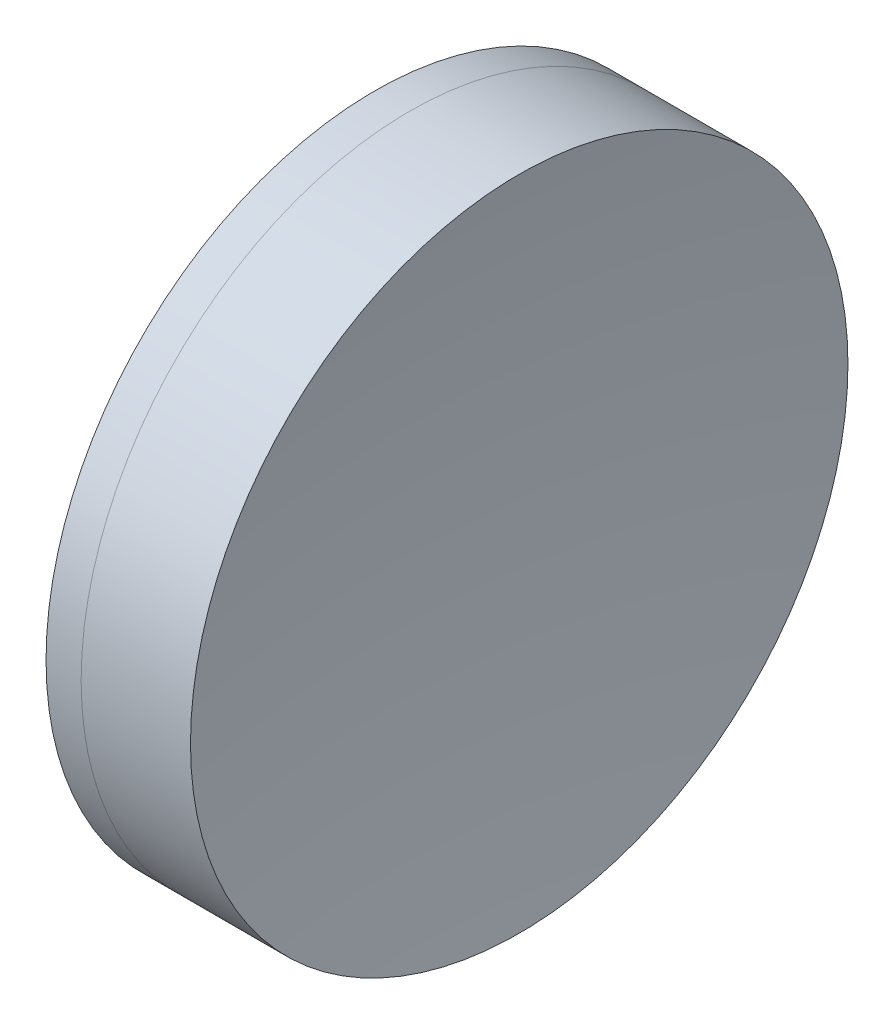
ISO-10303-21;
HEADER;
FILE_DESCRIPTION(('STEP AP214'),'2;1');
FILE_NAME('part.step','',(''),(''),'','','');
FILE_SCHEMA(('AUTOMOTIVE_DESIGN { 1 0 10303 214 1 1 1 1 }'));
ENDSEC;
DATA;
#1=APPLICATION_CONTEXT('core data for automotive mechanical design processes');
#2=APPLICATION_PROTOCOL_DEFINITION('international standard','automotive_design',2000,#1);
#3=PRODUCT_CONTEXT('',#1,'mechanical');
#4=PRODUCT('Part','Part','',(#3));
#5=PRODUCT_RELATED_PRODUCT_CATEGORY('part','',(#4));
#6=PRODUCT_DEFINITION_FORMATION('','',#4);
#7=PRODUCT_DEFINITION_CONTEXT('part definition',#1,'design');
#8=PRODUCT_DEFINITION('design','',#6,#7);
#9=PRODUCT_DEFINITION_SHAPE('','',#8);
#10=(LENGTH_UNIT() NAMED_UNIT(*) SI_UNIT(.MILLI.,.METRE.));
#11=(NAMED_UNIT(*) PLANE_ANGLE_UNIT() SI_UNIT($,.RADIAN.));
#12=(NAMED_UNIT(*) SI_UNIT($,.STERADIAN.) SOLID_ANGLE_UNIT());
#13=UNCERTAINTY_MEASURE_WITH_UNIT(LENGTH_MEASURE(1.E-05),#10,'distance_accuracy_value','');
#14=(GEOMETRIC_REPRESENTATION_CONTEXT(3) GLOBAL_UNCERTAINTY_ASSIGNED_CONTEXT((#13)) GLOBAL_UNIT_ASSIGNED_CONTEXT((#10,
#11,#12)) REPRESENTATION_CONTEXT('',''));
#15=CARTESIAN_POINT('',(0.,0.,0.));
#16=DIRECTION('',(0.,0.,1.));
#17=DIRECTION('',(1.,0.,0.));
#18=AXIS2_PLACEMENT_3D('',#15,#16,#17);
#19=CARTESIAN_POINT('',(292.405851818292,0.,-2.83082205629276E-13));
#20=DIRECTION('',(-1.,0.,0.));
#21=DIRECTION('',(0.,0.,1.));
#22=AXIS2_PLACEMENT_3D('',#19,#20,#21);
#23=SPHERICAL_SURFACE('',#22,62.7500000000001);
#24=CARTESIAN_POINT('',(353.857235041129,0.,0.));
#25=DIRECTION('',(-1.,0.,0.));
#26=DIRECTION('',(0.,0.,1.));
#27=AXIS2_PLACEMENT_3D('',#24,#25,#26);
#28=CIRCLE('',#27,12.6999999999997);
#29=CARTESIAN_POINT('',(353.857235041129,0.,12.6999999999997));
#30=VERTEX_POINT('',#29);
#31=EDGE_CURVE('E11',#30,#30,#28,.T.);
#32=ORIENTED_EDGE('',*,*,#31,.T.);
#33=EDGE_LOOP('',(#32));
#34=FACE_BOUND('',#33,.T.);
#35=ADVANCED_FACE('F45',(#34),#23,.F.);
#36=CARTESIAN_POINT('',(-0.551919992657797,0.,0.));
#37=DIRECTION('',(-1.,0.,0.));
#38=DIRECTION('',(0.,0.,1.));
#39=AXIS2_PLACEMENT_3D('',#36,#37,#38);
#40=CYLINDRICAL_SURFACE('',#39,12.6999999999999);
#41=CARTESIAN_POINT('',(358.081666208408,0.,0.));
#42=DIRECTION('',(-1.,0.,0.));
#43=DIRECTION('',(0.,0.,1.));
#44=AXIS2_PLACEMENT_3D('',#41,#42,#43);
#45=CIRCLE('',#44,12.7);
#46=CARTESIAN_POINT('',(358.081666208408,0.,12.7));
#47=VERTEX_POINT('',#46);
#48=EDGE_CURVE('E51',#47,#47,#45,.T.);
#49=ORIENTED_EDGE('',*,*,#48,.T.);
#50=EDGE_LOOP('',(#49));
#51=FACE_BOUND('',#50,.T.);
#52=ORIENTED_EDGE('',*,*,#31,.F.);
#53=EDGE_LOOP('',(#52));
#54=FACE_BOUND('',#53,.T.);
#55=ADVANCED_FACE('F57',(#51,#54),#40,.T.);
#56=CARTESIAN_POINT('',(444.725851818292,0.,0.));
#57=DIRECTION('',(-1.,0.,0.));
#58=DIRECTION('',(0.,0.,-1.));
#59=AXIS2_PLACEMENT_3D('',#56,#57,#58);
#60=SPHERICAL_SURFACE('',#59,87.57);
#61=ORIENTED_EDGE('',*,*,#48,.F.);
#62=EDGE_LOOP('',(#61));
#63=FACE_BOUND('',#62,.T.);
#64=ADVANCED_FACE('F60',(#63),#60,.F.);
#65=CLOSED_SHELL('',(#35,#55,#64));
#66=MANIFOLD_SOLID_BREP('B2',#65);
#67=CARTESIAN_POINT('',(411.755851818292,0.,-2.81099856730881E-13));
#68=DIRECTION('',(-1.,0.,0.));
#69=DIRECTION('',(0.,0.,1.));
#70=AXIS2_PLACEMENT_3D('',#67,#68,#69);
#71=SPHERICAL_SURFACE('',#70,60.6);
#72=CARTESIAN_POINT('',(352.50156927264,0.,0.));
#73=DIRECTION('',(-1.,0.,0.));
#74=DIRECTION('',(0.,0.,1.));
#75=AXIS2_PLACEMENT_3D('',#72,#73,#74);
#76=CIRCLE('',#75,12.6999999999997);
#77=CARTESIAN_POINT('',(352.50156927264,0.,12.6999999999997));
#78=VERTEX_POINT('',#77);
#79=EDGE_CURVE('E44',#78,#78,#76,.T.);
#80=ORIENTED_EDGE('',*,*,#79,.T.);
#81=EDGE_LOOP('',(#80));
#82=FACE_BOUND('',#81,.T.);
#83=ADVANCED_FACE('F86',(#82),#71,.T.);
#84=CARTESIAN_POINT('',(124.523309526045,0.,0.));
#85=DIRECTION('',(-1.,0.,0.));
#86=DIRECTION('',(0.,0.,1.));
#87=AXIS2_PLACEMENT_3D('',#84,#85,#86);
#88=CYLINDRICAL_SURFACE('',#87,12.6999999999997);
#89=CARTESIAN_POINT('',(353.857235041129,0.,0.));
#90=DIRECTION('',(-1.,0.,0.));
#91=DIRECTION('',(0.,0.,1.));
#92=AXIS2_PLACEMENT_3D('',#89,#90,#91);
#93=CIRCLE('',#92,12.6999999999997);
#94=CARTESIAN_POINT('',(353.857235041129,0.,12.6999999999997));
#95=VERTEX_POINT('',#94);
#96=EDGE_CURVE('E92',#95,#95,#93,.T.);
#97=ORIENTED_EDGE('',*,*,#96,.T.);
#98=EDGE_LOOP('',(#97));
#99=FACE_BOUND('',#98,.T.);
#100=ORIENTED_EDGE('',*,*,#79,.F.);
#101=EDGE_LOOP('',(#100));
#102=FACE_BOUND('',#101,.T.);
#103=ADVANCED_FACE('F98',(#99,#102),#88,.T.);
#104=CARTESIAN_POINT('',(292.405851818292,0.,-2.83082205629276E-13));
#105=DIRECTION('',(-1.,0.,0.));
#106=DIRECTION('',(0.,0.,1.));
#107=AXIS2_PLACEMENT_3D('',#104,#105,#106);
#108=SPHERICAL_SURFACE('',#107,62.7500000000001);
#109=ORIENTED_EDGE('',*,*,#96,.F.);
#110=EDGE_LOOP('',(#109));
#111=FACE_BOUND('',#110,.T.);
#112=ADVANCED_FACE('F101',(#111),#108,.T.);
#113=CLOSED_SHELL('',(#83,#103,#112));
#114=MANIFOLD_SOLID_BREP('B6',#113);
#115=ADVANCED_BREP_SHAPE_REPRESENTATION('',(#18,#66,#114),#14);
#116=SHAPE_DEFINITION_REPRESENTATION(#9,#115);
ENDSEC;
END-ISO-10303-21;
